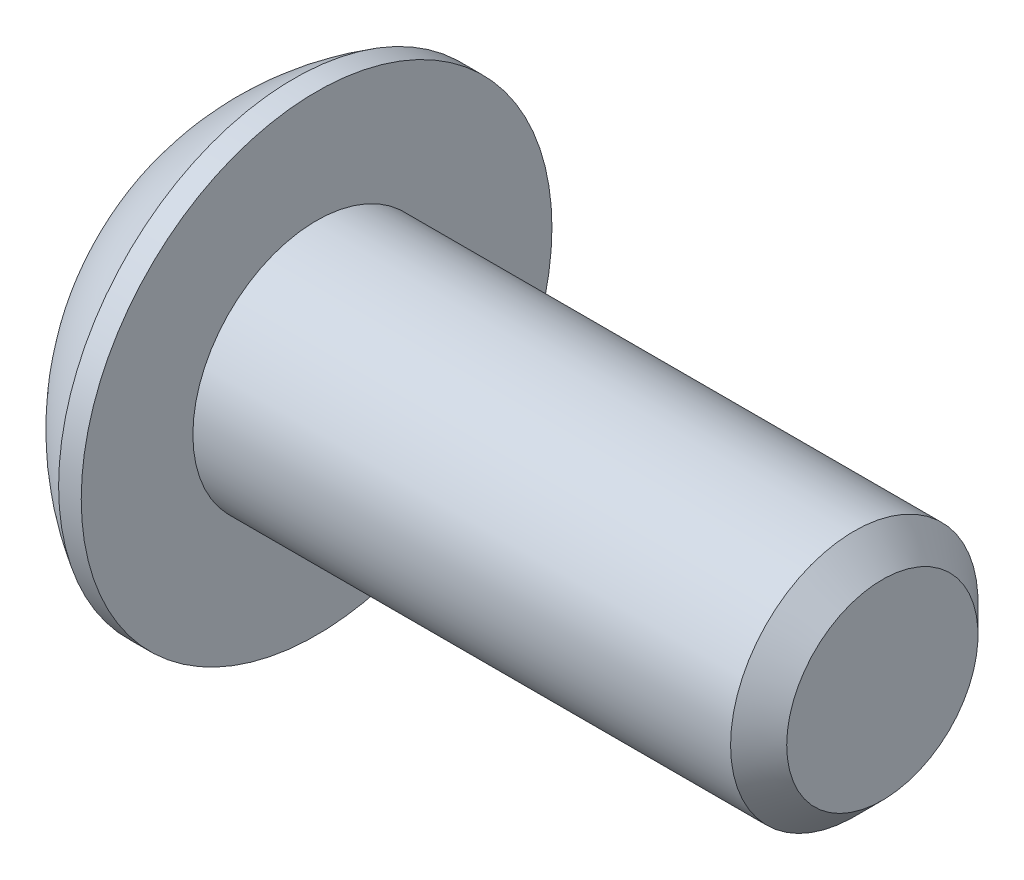
ISO-10303-21;
HEADER;
FILE_DESCRIPTION(('STEP AP214'),'2;1');
FILE_NAME('part.step','',(''),(''),'','','');
FILE_SCHEMA(('AUTOMOTIVE_DESIGN { 1 0 10303 214 1 1 1 1 }'));
ENDSEC;
DATA;
#1=APPLICATION_CONTEXT('core data for automotive mechanical design processes');
#2=APPLICATION_PROTOCOL_DEFINITION('international standard','automotive_design',2000,#1);
#3=PRODUCT_CONTEXT('',#1,'mechanical');
#4=PRODUCT('Part','Part','',(#3));
#5=PRODUCT_RELATED_PRODUCT_CATEGORY('part','',(#4));
#6=PRODUCT_DEFINITION_FORMATION('','',#4);
#7=PRODUCT_DEFINITION_CONTEXT('part definition',#1,'design');
#8=PRODUCT_DEFINITION('design','',#6,#7);
#9=PRODUCT_DEFINITION_SHAPE('','',#8);
#10=(LENGTH_UNIT() NAMED_UNIT(*) SI_UNIT(.MILLI.,.METRE.));
#11=(NAMED_UNIT(*) PLANE_ANGLE_UNIT() SI_UNIT($,.RADIAN.));
#12=(NAMED_UNIT(*) SI_UNIT($,.STERADIAN.) SOLID_ANGLE_UNIT());
#13=UNCERTAINTY_MEASURE_WITH_UNIT(LENGTH_MEASURE(1.E-05),#10,'distance_accuracy_value','');
#14=(GEOMETRIC_REPRESENTATION_CONTEXT(3) GLOBAL_UNCERTAINTY_ASSIGNED_CONTEXT((#13)) GLOBAL_UNIT_ASSIGNED_CONTEXT((#10,
#11,#12)) REPRESENTATION_CONTEXT('',''));
#15=CARTESIAN_POINT('',(0.,0.,0.));
#16=DIRECTION('',(0.,0.,1.));
#17=DIRECTION('',(1.,0.,0.));
#18=AXIS2_PLACEMENT_3D('',#15,#16,#17);
#19=CARTESIAN_POINT('',(1.32079999997359,0.,0.));
#20=DIRECTION('',(-1.,0.,0.));
#21=DIRECTION('',(0.,0.,1.));
#22=AXIS2_PLACEMENT_3D('',#19,#20,#21);
#23=CONICAL_SURFACE('',#22,1.19380000001001,1.04719755119008);
#24=CARTESIAN_POINT('',(2.0100407513155,0.,0.));
#25=VERTEX_POINT('',#24);
#26=VERTEX_LOOP('',#25);
#27=FACE_BOUND('',#26,.T.);
#28=CARTESIAN_POINT('',(1.32079999997359,0.,0.));
#29=DIRECTION('',(-1.,0.,0.));
#30=DIRECTION('',(0.,0.,1.));
#31=AXIS2_PLACEMENT_3D('',#28,#29,#30);
#32=CIRCLE('',#31,1.19380000001001);
#33=CARTESIAN_POINT('',(1.32079999998682,-1.0338611270422,0.596900000002503));
#34=VERTEX_POINT('',#33);
#35=CARTESIAN_POINT('',(1.32079999998682,0.,1.19380000000501));
#36=VERTEX_POINT('',#35);
#37=EDGE_CURVE('E91',#34,#36,#32,.T.);
#38=ORIENTED_EDGE('',*,*,#37,.T.);
#39=CARTESIAN_POINT('',(1.32079999997359,0.,0.));
#40=DIRECTION('',(-1.,0.,0.));
#41=DIRECTION('',(0.,0.,1.));
#42=AXIS2_PLACEMENT_3D('',#39,#40,#41);
#43=CIRCLE('',#42,1.19380000001001);
#44=CARTESIAN_POINT('',(1.32079999998682,1.0338611270422,0.596900000002504));
#45=VERTEX_POINT('',#44);
#46=EDGE_CURVE('E87',#36,#45,#43,.T.);
#47=ORIENTED_EDGE('',*,*,#46,.T.);
#48=CARTESIAN_POINT('',(1.32079999997359,0.,0.));
#49=DIRECTION('',(-1.,0.,0.));
#50=DIRECTION('',(0.,0.,1.));
#51=AXIS2_PLACEMENT_3D('',#48,#49,#50);
#52=CIRCLE('',#51,1.19380000001001);
#53=CARTESIAN_POINT('',(1.32079999998682,1.0338611270422,-0.596900000002504));
#54=VERTEX_POINT('',#53);
#55=EDGE_CURVE('E20',#45,#54,#52,.T.);
#56=ORIENTED_EDGE('',*,*,#55,.T.);
#57=CARTESIAN_POINT('',(1.32079999997359,0.,0.));
#58=DIRECTION('',(-1.,0.,0.));
#59=DIRECTION('',(0.,0.,1.));
#60=AXIS2_PLACEMENT_3D('',#57,#58,#59);
#61=CIRCLE('',#60,1.19380000001001);
#62=CARTESIAN_POINT('',(1.32079999998682,1.49461108489558E-12,-1.19380000000501));
#63=VERTEX_POINT('',#62);
#64=EDGE_CURVE('E150',#54,#63,#61,.T.);
#65=ORIENTED_EDGE('',*,*,#64,.T.);
#66=CARTESIAN_POINT('',(1.32079999997359,0.,0.));
#67=DIRECTION('',(-1.,0.,0.));
#68=DIRECTION('',(0.,0.,1.));
#69=AXIS2_PLACEMENT_3D('',#66,#67,#68);
#70=CIRCLE('',#69,1.19380000001001);
#71=CARTESIAN_POINT('',(1.32079999998682,-1.0338611270422,-0.596900000002503));
#72=VERTEX_POINT('',#71);
#73=EDGE_CURVE('E152',#63,#72,#70,.T.);
#74=ORIENTED_EDGE('',*,*,#73,.T.);
#75=CARTESIAN_POINT('',(1.32079999997359,0.,0.));
#76=DIRECTION('',(-1.,0.,0.));
#77=DIRECTION('',(0.,0.,1.));
#78=AXIS2_PLACEMENT_3D('',#75,#76,#77);
#79=CIRCLE('',#78,1.19380000001001);
#80=EDGE_CURVE('E154',#72,#34,#79,.T.);
#81=ORIENTED_EDGE('',*,*,#80,.T.);
#82=EDGE_LOOP('',(#38,#47,#56,#65,#74,#81));
#83=FACE_BOUND('',#82,.T.);
#84=ADVANCED_FACE('F16',(#27,#83),#23,.F.);
#85=CARTESIAN_POINT('',(1.3208,-2.06772225407572,-1.1938));
#86=DIRECTION('',(1.,0.,0.));
#87=DIRECTION('',(0.,0.,-1.));
#88=AXIS2_PLACEMENT_3D('',#85,#86,#87);
#89=PLANE('',#88);
#90=DIRECTION('',(0.,-0.5,-0.866025403784439));
#91=VECTOR('',#90,1.);
#92=CARTESIAN_POINT('',(1.32080000000004,1.37848150271715,0.));
#93=LINE('',#92,#91);
#94=CARTESIAN_POINT('',(1.32080000000001,1.37848150271715,0.));
#95=VERTEX_POINT('',#94);
#96=EDGE_CURVE('E103',#54,#95,#93,.F.);
#97=ORIENTED_EDGE('',*,*,#96,.F.);
#98=ORIENTED_EDGE('',*,*,#55,.F.);
#99=DIRECTION('',(0.,0.5,-0.866025403784439));
#100=VECTOR('',#99,1.);
#101=CARTESIAN_POINT('',(1.3208,0.689240751358576,1.1938));
#102=LINE('',#101,#100);
#103=EDGE_CURVE('E101',#95,#45,#102,.F.);
#104=ORIENTED_EDGE('',*,*,#103,.F.);
#105=EDGE_LOOP('',(#97,#98,#104));
#106=FACE_BOUND('',#105,.T.);
#107=ADVANCED_FACE('F99',(#106),#89,.F.);
#108=CARTESIAN_POINT('',(1.3208,-2.06772225407572,-1.1938));
#109=DIRECTION('',(1.,0.,0.));
#110=DIRECTION('',(0.,0.,-1.));
#111=AXIS2_PLACEMENT_3D('',#108,#109,#110);
#112=PLANE('',#111);
#113=DIRECTION('',(0.,0.5,-0.866025403784439));
#114=VECTOR('',#113,1.);
#115=CARTESIAN_POINT('',(1.32080000000004,0.689240751358576,1.1938));
#116=LINE('',#115,#114);
#117=CARTESIAN_POINT('',(1.32080000000001,0.689240751358576,1.1938));
#118=VERTEX_POINT('',#117);
#119=EDGE_CURVE('E105',#45,#118,#116,.F.);
#120=ORIENTED_EDGE('',*,*,#119,.F.);
#121=ORIENTED_EDGE('',*,*,#46,.F.);
#122=DIRECTION('',(0.,1.,0.));
#123=VECTOR('',#122,1.);
#124=CARTESIAN_POINT('',(1.3208,-0.689240751358574,1.1938));
#125=LINE('',#124,#123);
#126=EDGE_CURVE('E108',#118,#36,#125,.F.);
#127=ORIENTED_EDGE('',*,*,#126,.F.);
#128=EDGE_LOOP('',(#120,#121,#127));
#129=FACE_BOUND('',#128,.T.);
#130=ADVANCED_FACE('F106',(#129),#112,.F.);
#131=CARTESIAN_POINT('',(1.3208,-2.06772225407572,-1.1938));
#132=DIRECTION('',(1.,0.,0.));
#133=DIRECTION('',(0.,0.,-1.));
#134=AXIS2_PLACEMENT_3D('',#131,#132,#133);
#135=PLANE('',#134);
#136=DIRECTION('',(0.,1.,0.));
#137=VECTOR('',#136,1.);
#138=CARTESIAN_POINT('',(1.32080000000004,-0.689240751358574,1.1938));
#139=LINE('',#138,#137);
#140=CARTESIAN_POINT('',(1.32080000000001,-0.689240751358574,1.1938));
#141=VERTEX_POINT('',#140);
#142=EDGE_CURVE('E168',#36,#141,#139,.F.);
#143=ORIENTED_EDGE('',*,*,#142,.F.);
#144=ORIENTED_EDGE('',*,*,#37,.F.);
#145=DIRECTION('',(0.,0.5,0.866025403784439));
#146=VECTOR('',#145,1.);
#147=CARTESIAN_POINT('',(1.3208,-1.37848150271715,0.));
#148=LINE('',#147,#146);
#149=EDGE_CURVE('E166',#141,#34,#148,.F.);
#150=ORIENTED_EDGE('',*,*,#149,.F.);
#151=EDGE_LOOP('',(#143,#144,#150));
#152=FACE_BOUND('',#151,.T.);
#153=ADVANCED_FACE('F164',(#152),#135,.F.);
#154=CARTESIAN_POINT('',(1.3208,-2.06772225407572,-1.1938));
#155=DIRECTION('',(1.,0.,0.));
#156=DIRECTION('',(0.,0.,-1.));
#157=AXIS2_PLACEMENT_3D('',#154,#155,#156);
#158=PLANE('',#157);
#159=DIRECTION('',(0.,0.5,0.866025403784439));
#160=VECTOR('',#159,1.);
#161=CARTESIAN_POINT('',(1.32080000000004,-1.37848150271715,0.));
#162=LINE('',#161,#160);
#163=CARTESIAN_POINT('',(1.32080000000001,-1.37848150271715,0.));
#164=VERTEX_POINT('',#163);
#165=EDGE_CURVE('E169',#34,#164,#162,.F.);
#166=ORIENTED_EDGE('',*,*,#165,.F.);
#167=ORIENTED_EDGE('',*,*,#80,.F.);
#168=DIRECTION('',(0.,-0.5,0.866025403784439));
#169=VECTOR('',#168,1.);
#170=CARTESIAN_POINT('',(1.3208,-0.689240751358574,-1.1938));
#171=LINE('',#170,#169);
#172=EDGE_CURVE('E172',#164,#72,#171,.F.);
#173=ORIENTED_EDGE('',*,*,#172,.F.);
#174=EDGE_LOOP('',(#166,#167,#173));
#175=FACE_BOUND('',#174,.T.);
#176=ADVANCED_FACE('F170',(#175),#158,.F.);
#177=CARTESIAN_POINT('',(1.3208,-2.06772225407572,-1.1938));
#178=DIRECTION('',(1.,0.,0.));
#179=DIRECTION('',(0.,0.,-1.));
#180=AXIS2_PLACEMENT_3D('',#177,#178,#179);
#181=PLANE('',#180);
#182=DIRECTION('',(0.,-0.5,0.866025403784439));
#183=VECTOR('',#182,1.);
#184=CARTESIAN_POINT('',(1.32080000000004,-0.689240751358574,-1.1938));
#185=LINE('',#184,#183);
#186=CARTESIAN_POINT('',(1.32080000000001,-0.689240751358574,-1.1938));
#187=VERTEX_POINT('',#186);
#188=EDGE_CURVE('E227',#72,#187,#185,.F.);
#189=ORIENTED_EDGE('',*,*,#188,.F.);
#190=ORIENTED_EDGE('',*,*,#73,.F.);
#191=DIRECTION('',(0.,1.,0.));
#192=VECTOR('',#191,1.);
#193=CARTESIAN_POINT('',(1.3208,0.689240751358577,-1.1938));
#194=LINE('',#193,#192);
#195=EDGE_CURVE('E239',#187,#63,#194,.T.);
#196=ORIENTED_EDGE('',*,*,#195,.F.);
#197=EDGE_LOOP('',(#189,#190,#196));
#198=FACE_BOUND('',#197,.T.);
#199=ADVANCED_FACE('F389',(#198),#181,.F.);
#200=CARTESIAN_POINT('',(1.3208,-2.06772225407572,-1.1938));
#201=DIRECTION('',(1.,0.,0.));
#202=DIRECTION('',(0.,0.,-1.));
#203=AXIS2_PLACEMENT_3D('',#200,#201,#202);
#204=PLANE('',#203);
#205=DIRECTION('',(0.,1.,0.));
#206=VECTOR('',#205,1.);
#207=CARTESIAN_POINT('',(1.32080000000004,0.689240751358577,-1.1938));
#208=LINE('',#207,#206);
#209=CARTESIAN_POINT('',(1.32080000000002,0.689240751358565,-1.19380000000002));
#210=VERTEX_POINT('',#209);
#211=EDGE_CURVE('E247',#63,#210,#208,.T.);
#212=ORIENTED_EDGE('',*,*,#211,.F.);
#213=ORIENTED_EDGE('',*,*,#64,.F.);
#214=DIRECTION('',(0.,-0.5,-0.866025403784439));
#215=VECTOR('',#214,1.);
#216=CARTESIAN_POINT('',(1.3208,1.37848150271715,0.));
#217=LINE('',#216,#215);
#218=EDGE_CURVE('E127',#210,#54,#217,.F.);
#219=ORIENTED_EDGE('',*,*,#218,.F.);
#220=EDGE_LOOP('',(#212,#213,#219));
#221=FACE_BOUND('',#220,.T.);
#222=ADVANCED_FACE('F379',(#221),#204,.F.);
#223=CARTESIAN_POINT('',(1.3208,1.37848150271715,0.));
#224=DIRECTION('',(0.,-0.866025403784439,0.5));
#225=DIRECTION('',(0.,-0.5,-0.866025403784439));
#226=AXIS2_PLACEMENT_3D('',#223,#224,#225);
#227=PLANE('',#226);
#228=ORIENTED_EDGE('',*,*,#96,.T.);
#229=DIRECTION('',(1.,0.,0.));
#230=VECTOR('',#229,1.);
#231=CARTESIAN_POINT('',(1.3208,1.37848150271715,0.));
#232=LINE('',#231,#230);
#233=CARTESIAN_POINT('',(0.,1.37848150271715,0.));
#234=VERTEX_POINT('',#233);
#235=EDGE_CURVE('E115',#234,#95,#232,.T.);
#236=ORIENTED_EDGE('',*,*,#235,.F.);
#237=DIRECTION('',(0.,0.5,0.866025403784439));
#238=VECTOR('',#237,1.);
#239=CARTESIAN_POINT('',(0.,0.689240751358577,-1.1938));
#240=LINE('',#239,#238);
#241=CARTESIAN_POINT('',(0.,0.689240751358577,-1.1938));
#242=VERTEX_POINT('',#241);
#243=EDGE_CURVE('E130',#242,#234,#240,.T.);
#244=ORIENTED_EDGE('',*,*,#243,.F.);
#245=DIRECTION('',(1.,0.,0.));
#246=VECTOR('',#245,1.);
#247=CARTESIAN_POINT('',(1.3208,0.689240751358577,-1.1938));
#248=LINE('',#247,#246);
#249=EDGE_CURVE('E134',#210,#242,#248,.F.);
#250=ORIENTED_EDGE('',*,*,#249,.F.);
#251=ORIENTED_EDGE('',*,*,#218,.T.);
#252=EDGE_LOOP('',(#228,#236,#244,#250,#251));
#253=FACE_BOUND('',#252,.T.);
#254=ADVANCED_FACE('F370',(#253),#227,.T.);
#255=CARTESIAN_POINT('',(1.3208,0.689240751358576,1.1938));
#256=DIRECTION('',(0.,-0.866025403784439,-0.5));
#257=DIRECTION('',(0.,0.5,-0.866025403784439));
#258=AXIS2_PLACEMENT_3D('',#255,#256,#257);
#259=PLANE('',#258);
#260=ORIENTED_EDGE('',*,*,#119,.T.);
#261=DIRECTION('',(1.,0.,0.));
#262=VECTOR('',#261,1.);
#263=CARTESIAN_POINT('',(1.3208,0.689240751358576,1.1938));
#264=LINE('',#263,#262);
#265=CARTESIAN_POINT('',(0.,0.689240751358577,1.1938));
#266=VERTEX_POINT('',#265);
#267=EDGE_CURVE('E111',#266,#118,#264,.T.);
#268=ORIENTED_EDGE('',*,*,#267,.F.);
#269=DIRECTION('',(0.,-0.5,0.866025403784439));
#270=VECTOR('',#269,1.);
#271=CARTESIAN_POINT('',(0.,1.37848150271715,0.));
#272=LINE('',#271,#270);
#273=EDGE_CURVE('E133',#234,#266,#272,.T.);
#274=ORIENTED_EDGE('',*,*,#273,.F.);
#275=ORIENTED_EDGE('',*,*,#235,.T.);
#276=ORIENTED_EDGE('',*,*,#103,.T.);
#277=EDGE_LOOP('',(#260,#268,#274,#275,#276));
#278=FACE_BOUND('',#277,.T.);
#279=ADVANCED_FACE('F113',(#278),#259,.T.);
#280=CARTESIAN_POINT('',(1.3208,-0.689240751358574,1.1938));
#281=DIRECTION('',(0.,0.,-1.));
#282=DIRECTION('',(0.,1.,0.));
#283=AXIS2_PLACEMENT_3D('',#280,#281,#282);
#284=PLANE('',#283);
#285=ORIENTED_EDGE('',*,*,#142,.T.);
#286=DIRECTION('',(1.,0.,0.));
#287=VECTOR('',#286,1.);
#288=CARTESIAN_POINT('',(1.3208,-0.689240751358574,1.1938));
#289=LINE('',#288,#287);
#290=CARTESIAN_POINT('',(0.,-0.689240751358574,1.1938));
#291=VERTEX_POINT('',#290);
#292=EDGE_CURVE('E179',#291,#141,#289,.T.);
#293=ORIENTED_EDGE('',*,*,#292,.F.);
#294=DIRECTION('',(0.,1.,0.));
#295=VECTOR('',#294,1.);
#296=CARTESIAN_POINT('',(0.,0.,1.1938));
#297=LINE('',#296,#295);
#298=EDGE_CURVE('E193',#266,#291,#297,.F.);
#299=ORIENTED_EDGE('',*,*,#298,.F.);
#300=ORIENTED_EDGE('',*,*,#267,.T.);
#301=ORIENTED_EDGE('',*,*,#126,.T.);
#302=EDGE_LOOP('',(#285,#293,#299,#300,#301));
#303=FACE_BOUND('',#302,.T.);
#304=ADVANCED_FACE('F215',(#303),#284,.T.);
#305=CARTESIAN_POINT('',(1.3208,-1.37848150271715,0.));
#306=DIRECTION('',(0.,0.866025403784439,-0.5));
#307=DIRECTION('',(0.,0.5,0.866025403784439));
#308=AXIS2_PLACEMENT_3D('',#305,#306,#307);
#309=PLANE('',#308);
#310=ORIENTED_EDGE('',*,*,#165,.T.);
#311=DIRECTION('',(1.,0.,0.));
#312=VECTOR('',#311,1.);
#313=CARTESIAN_POINT('',(1.3208,-1.37848150271715,0.));
#314=LINE('',#313,#312);
#315=CARTESIAN_POINT('',(0.,-1.37848150271715,0.));
#316=VERTEX_POINT('',#315);
#317=EDGE_CURVE('E175',#316,#164,#314,.T.);
#318=ORIENTED_EDGE('',*,*,#317,.F.);
#319=DIRECTION('',(0.,-0.5,-0.866025403784439));
#320=VECTOR('',#319,1.);
#321=CARTESIAN_POINT('',(0.,-0.689240751358574,1.1938));
#322=LINE('',#321,#320);
#323=EDGE_CURVE('E196',#291,#316,#322,.T.);
#324=ORIENTED_EDGE('',*,*,#323,.F.);
#325=ORIENTED_EDGE('',*,*,#292,.T.);
#326=ORIENTED_EDGE('',*,*,#149,.T.);
#327=EDGE_LOOP('',(#310,#318,#324,#325,#326));
#328=FACE_BOUND('',#327,.T.);
#329=ADVANCED_FACE('F177',(#328),#309,.T.);
#330=CARTESIAN_POINT('',(1.3208,-0.689240751358574,-1.1938));
#331=DIRECTION('',(0.,0.866025403784439,0.5));
#332=DIRECTION('',(0.,-0.5,0.866025403784439));
#333=AXIS2_PLACEMENT_3D('',#330,#331,#332);
#334=PLANE('',#333);
#335=ORIENTED_EDGE('',*,*,#188,.T.);
#336=DIRECTION('',(1.,0.,0.));
#337=VECTOR('',#336,1.);
#338=CARTESIAN_POINT('',(1.3208,-0.689240751358574,-1.1938));
#339=LINE('',#338,#337);
#340=CARTESIAN_POINT('',(0.,-0.689240751358574,-1.1938));
#341=VERTEX_POINT('',#340);
#342=EDGE_CURVE('E35',#341,#187,#339,.T.);
#343=ORIENTED_EDGE('',*,*,#342,.F.);
#344=DIRECTION('',(0.,0.5,-0.866025403784439));
#345=VECTOR('',#344,1.);
#346=CARTESIAN_POINT('',(0.,-1.37848150271715,0.));
#347=LINE('',#346,#345);
#348=EDGE_CURVE('E216',#316,#341,#347,.T.);
#349=ORIENTED_EDGE('',*,*,#348,.F.);
#350=ORIENTED_EDGE('',*,*,#317,.T.);
#351=ORIENTED_EDGE('',*,*,#172,.T.);
#352=EDGE_LOOP('',(#335,#343,#349,#350,#351));
#353=FACE_BOUND('',#352,.T.);
#354=ADVANCED_FACE('F336',(#353),#334,.T.);
#355=CARTESIAN_POINT('',(1.3208,0.689240751358577,-1.1938));
#356=DIRECTION('',(0.,0.,1.));
#357=DIRECTION('',(1.,0.,0.));
#358=AXIS2_PLACEMENT_3D('',#355,#356,#357);
#359=PLANE('',#358);
#360=ORIENTED_EDGE('',*,*,#211,.T.);
#361=ORIENTED_EDGE('',*,*,#249,.T.);
#362=DIRECTION('',(0.,1.,0.));
#363=VECTOR('',#362,1.);
#364=CARTESIAN_POINT('',(0.,0.,-1.1938));
#365=LINE('',#364,#363);
#366=EDGE_CURVE('E149',#341,#242,#365,.T.);
#367=ORIENTED_EDGE('',*,*,#366,.F.);
#368=ORIENTED_EDGE('',*,*,#342,.T.);
#369=ORIENTED_EDGE('',*,*,#195,.T.);
#370=EDGE_LOOP('',(#360,#361,#367,#368,#369));
#371=FACE_BOUND('',#370,.T.);
#372=ADVANCED_FACE('F327',(#371),#359,.T.);
#373=CARTESIAN_POINT('',(0.,0.,0.));
#374=DIRECTION('',(-1.,0.,0.));
#375=DIRECTION('',(0.,0.,1.));
#376=AXIS2_PLACEMENT_3D('',#373,#374,#375);
#377=PLANE('',#376);
#378=CARTESIAN_POINT('',(0.,0.,0.));
#379=DIRECTION('',(-1.,0.,0.));
#380=DIRECTION('',(0.,0.,1.));
#381=AXIS2_PLACEMENT_3D('',#378,#379,#380);
#382=CIRCLE('',#381,1.9812);
#383=CARTESIAN_POINT('',(0.,0.,1.9812));
#384=VERTEX_POINT('',#383);
#385=EDGE_CURVE('E146',#384,#384,#382,.F.);
#386=ORIENTED_EDGE('',*,*,#385,.F.);
#387=EDGE_LOOP('',(#386));
#388=FACE_BOUND('',#387,.T.);
#389=ORIENTED_EDGE('',*,*,#348,.T.);
#390=ORIENTED_EDGE('',*,*,#366,.T.);
#391=ORIENTED_EDGE('',*,*,#243,.T.);
#392=ORIENTED_EDGE('',*,*,#273,.T.);
#393=ORIENTED_EDGE('',*,*,#298,.T.);
#394=ORIENTED_EDGE('',*,*,#323,.T.);
#395=EDGE_LOOP('',(#389,#390,#391,#392,#393,#394));
#396=FACE_BOUND('',#395,.T.);
#397=ADVANCED_FACE('F209',(#388,#396),#377,.T.);
#398=CARTESIAN_POINT('',(4.13385,0.,0.));
#399=DIRECTION('',(0.,1.,0.));
#400=DIRECTION('',(-0.489667403954941,0.,-0.871909303485189));
#401=AXIS2_PLACEMENT_3D('',#398,#399,#400);
#402=SPHERICAL_SURFACE('',#401,4.58408870578439);
#403=CARTESIAN_POINT('',(4.13385,0.,0.));
#404=DIRECTION('',(-1.,0.,0.));
#405=DIRECTION('',(0.,0.,1.));
#406=AXIS2_PLACEMENT_3D('',#403,#404,#405);
#407=SPHERICAL_SURFACE('',#406,4.58408870578439);
#408=ORIENTED_EDGE('',*,*,#385,.T.);
#409=EDGE_LOOP('',(#408));
#410=FACE_BOUND('',#409,.T.);
#411=CARTESIAN_POINT('',(1.8288,0.,0.));
#412=DIRECTION('',(-1.,0.,0.));
#413=DIRECTION('',(0.,0.,1.));
#414=AXIS2_PLACEMENT_3D('',#411,#412,#413);
#415=CIRCLE('',#414,3.9624);
#416=CARTESIAN_POINT('',(1.8288,0.,3.9624));
#417=VERTEX_POINT('',#416);
#418=EDGE_CURVE('E143',#417,#417,#415,.F.);
#419=ORIENTED_EDGE('',*,*,#418,.F.);
#420=EDGE_LOOP('',(#419));
#421=FACE_BOUND('',#420,.T.);
#422=ADVANCED_FACE('F18',(#410,#421),#407,.T.);
#423=CARTESIAN_POINT('',(11.7348,0.,0.));
#424=DIRECTION('',(-1.,0.,0.));
#425=DIRECTION('',(0.,0.,1.));
#426=AXIS2_PLACEMENT_3D('',#423,#424,#425);
#427=PLANE('',#426);
#428=CARTESIAN_POINT('',(11.7347999999993,0.,0.));
#429=DIRECTION('',(-1.,0.,0.));
#430=DIRECTION('',(0.,0.,1.));
#431=AXIS2_PLACEMENT_3D('',#428,#429,#430);
#432=CIRCLE('',#431,1.61035999997239);
#433=CARTESIAN_POINT('',(11.7347999999993,0.,1.61035999997239));
#434=VERTEX_POINT('',#433);
#435=EDGE_CURVE('E140',#434,#434,#432,.T.);
#436=ORIENTED_EDGE('',*,*,#435,.F.);
#437=EDGE_LOOP('',(#436));
#438=FACE_BOUND('',#437,.T.);
#439=ADVANCED_FACE('F269',(#438),#427,.F.);
#440=CARTESIAN_POINT('',(0.,0.,0.));
#441=DIRECTION('',(-1.,0.,0.));
#442=DIRECTION('',(0.,0.,1.));
#443=AXIS2_PLACEMENT_3D('',#440,#441,#442);
#444=CYLINDRICAL_SURFACE('',#443,3.9624);
#445=ORIENTED_EDGE('',*,*,#418,.T.);
#446=EDGE_LOOP('',(#445));
#447=FACE_BOUND('',#446,.T.);
#448=CARTESIAN_POINT('',(2.2098,0.,0.));
#449=DIRECTION('',(-1.,0.,0.));
#450=DIRECTION('',(0.,0.,1.));
#451=AXIS2_PLACEMENT_3D('',#448,#449,#450);
#452=CIRCLE('',#451,3.9624);
#453=CARTESIAN_POINT('',(2.2098,0.,3.9624));
#454=VERTEX_POINT('',#453);
#455=EDGE_CURVE('E137',#454,#454,#452,.T.);
#456=ORIENTED_EDGE('',*,*,#455,.T.);
#457=EDGE_LOOP('',(#456));
#458=FACE_BOUND('',#457,.T.);
#459=ADVANCED_FACE('F265',(#447,#458),#444,.T.);
#460=CARTESIAN_POINT('',(11.2623600001029,0.,0.));
#461=DIRECTION('',(-1.,0.,0.));
#462=DIRECTION('',(0.,0.,1.));
#463=AXIS2_PLACEMENT_3D('',#460,#461,#462);
#464=CONICAL_SURFACE('',#463,2.08279999986871,0.785398163397448);
#465=CARTESIAN_POINT('',(11.26236,0.,0.));
#466=DIRECTION('',(-1.,0.,0.));
#467=DIRECTION('',(0.,0.,1.));
#468=AXIS2_PLACEMENT_3D('',#465,#466,#467);
#469=CIRCLE('',#468,2.0828);
#470=CARTESIAN_POINT('',(11.26236,0.,2.0828));
#471=VERTEX_POINT('',#470);
#472=EDGE_CURVE('E26',#471,#471,#469,.T.);
#473=ORIENTED_EDGE('',*,*,#472,.F.);
#474=EDGE_LOOP('',(#473));
#475=FACE_BOUND('',#474,.T.);
#476=ORIENTED_EDGE('',*,*,#435,.T.);
#477=EDGE_LOOP('',(#476));
#478=FACE_BOUND('',#477,.T.);
#479=ADVANCED_FACE('F261',(#475,#478),#464,.T.);
#480=CARTESIAN_POINT('',(2.2098,2.0828,0.));
#481=DIRECTION('',(-1.,0.,0.));
#482=DIRECTION('',(0.,0.,1.));
#483=AXIS2_PLACEMENT_3D('',#480,#481,#482);
#484=PLANE('',#483);
#485=ORIENTED_EDGE('',*,*,#455,.F.);
#486=EDGE_LOOP('',(#485));
#487=FACE_BOUND('',#486,.T.);
#488=CARTESIAN_POINT('',(2.2098,0.,0.));
#489=DIRECTION('',(-1.,0.,0.));
#490=DIRECTION('',(0.,0.,1.));
#491=AXIS2_PLACEMENT_3D('',#488,#489,#490);
#492=CIRCLE('',#491,2.0828);
#493=CARTESIAN_POINT('',(2.2098,0.,2.0828));
#494=VERTEX_POINT('',#493);
#495=EDGE_CURVE('E11',#494,#494,#492,.F.);
#496=ORIENTED_EDGE('',*,*,#495,.F.);
#497=EDGE_LOOP('',(#496));
#498=FACE_BOUND('',#497,.T.);
#499=ADVANCED_FACE('F264',(#487,#498),#484,.F.);
#500=CARTESIAN_POINT('',(0.,0.,0.));
#501=DIRECTION('',(-1.,0.,0.));
#502=DIRECTION('',(0.,0.,1.));
#503=AXIS2_PLACEMENT_3D('',#500,#501,#502);
#504=CYLINDRICAL_SURFACE('',#503,2.0828);
#505=ORIENTED_EDGE('',*,*,#495,.T.);
#506=EDGE_LOOP('',(#505));
#507=FACE_BOUND('',#506,.T.);
#508=ORIENTED_EDGE('',*,*,#472,.T.);
#509=EDGE_LOOP('',(#508));
#510=FACE_BOUND('',#509,.T.);
#511=ADVANCED_FACE('F259',(#507,#510),#504,.T.);
#512=CLOSED_SHELL('',(#84,#107,#130,#153,#176,#199,#222,#254,#279,#304,#329,#354,#372,#397,#422,
#439,#459,#479,#499,#511));
#513=MANIFOLD_SOLID_BREP('B1',#512);
#514=ADVANCED_BREP_SHAPE_REPRESENTATION('',(#18,#513),#14);
#515=SHAPE_DEFINITION_REPRESENTATION(#9,#514);
ENDSEC;
END-ISO-10303-21;
